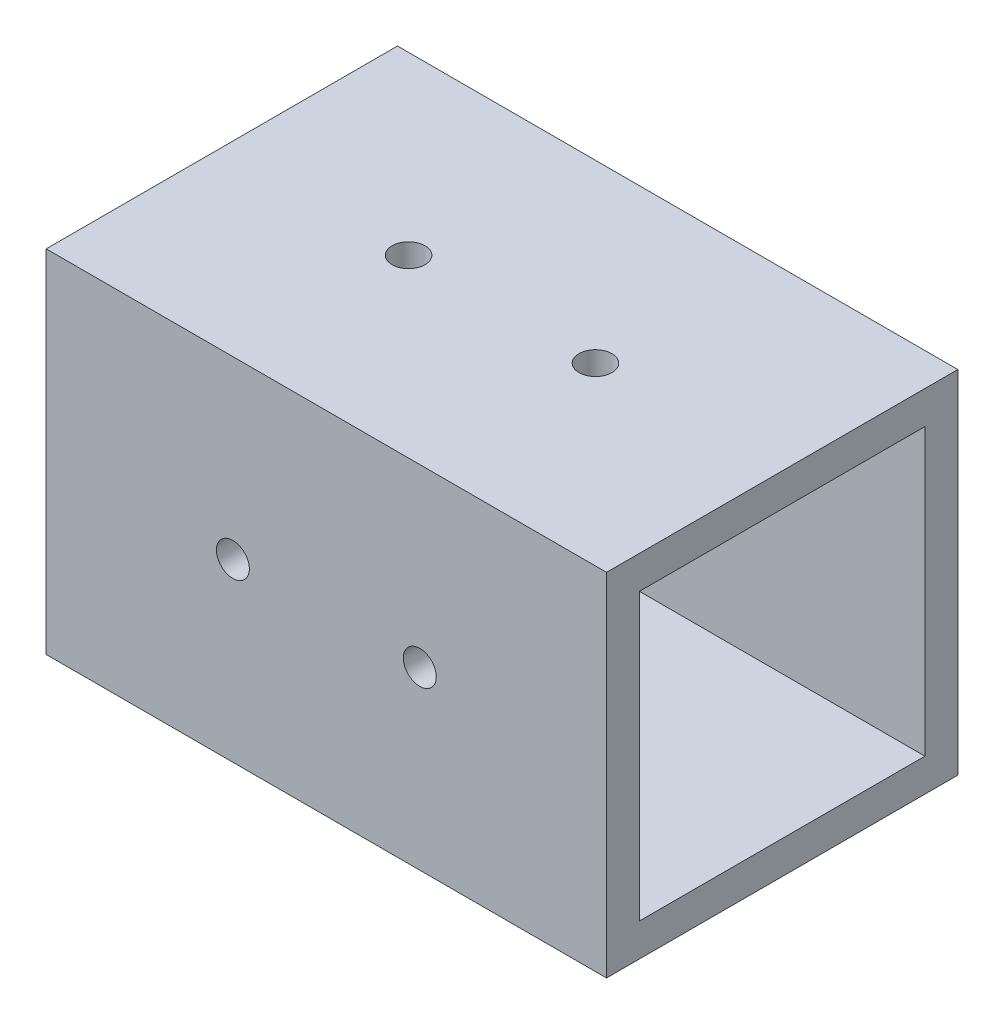
ISO-10303-21;
HEADER;
FILE_DESCRIPTION(('STEP AP214'),'2;1');
FILE_NAME('part.step','',(''),(''),'','','');
FILE_SCHEMA(('AUTOMOTIVE_DESIGN { 1 0 10303 214 1 1 1 1 }'));
ENDSEC;
DATA;
#1=APPLICATION_CONTEXT('core data for automotive mechanical design processes');
#2=APPLICATION_PROTOCOL_DEFINITION('international standard','automotive_design',2000,#1);
#3=PRODUCT_CONTEXT('',#1,'mechanical');
#4=PRODUCT('Part','Part','',(#3));
#5=PRODUCT_RELATED_PRODUCT_CATEGORY('part','',(#4));
#6=PRODUCT_DEFINITION_FORMATION('','',#4);
#7=PRODUCT_DEFINITION_CONTEXT('part definition',#1,'design');
#8=PRODUCT_DEFINITION('design','',#6,#7);
#9=PRODUCT_DEFINITION_SHAPE('','',#8);
#10=(LENGTH_UNIT() NAMED_UNIT(*) SI_UNIT(.MILLI.,.METRE.));
#11=(NAMED_UNIT(*) PLANE_ANGLE_UNIT() SI_UNIT($,.RADIAN.));
#12=(NAMED_UNIT(*) SI_UNIT($,.STERADIAN.) SOLID_ANGLE_UNIT());
#13=UNCERTAINTY_MEASURE_WITH_UNIT(LENGTH_MEASURE(1.E-05),#10,'distance_accuracy_value','');
#14=(GEOMETRIC_REPRESENTATION_CONTEXT(3) GLOBAL_UNCERTAINTY_ASSIGNED_CONTEXT((#13)) GLOBAL_UNIT_ASSIGNED_CONTEXT((#10,
#11,#12)) REPRESENTATION_CONTEXT('',''));
#15=CARTESIAN_POINT('',(0.,0.,0.));
#16=DIRECTION('',(0.,0.,1.));
#17=DIRECTION('',(1.,0.,0.));
#18=AXIS2_PLACEMENT_3D('',#15,#16,#17);
#19=CARTESIAN_POINT('',(81.025,0.,0.));
#20=DIRECTION('',(1.,0.,0.));
#21=DIRECTION('',(0.,0.,-1.));
#22=AXIS2_PLACEMENT_3D('',#19,#20,#21);
#23=PLANE('',#22);
#24=DIRECTION('',(0.,1.,0.));
#25=VECTOR('',#24,1.);
#26=CARTESIAN_POINT('',(81.025,0.,0.));
#27=LINE('',#26,#25);
#28=CARTESIAN_POINT('',(81.025,0.,0.));
#29=VERTEX_POINT('',#28);
#30=CARTESIAN_POINT('',(81.025,50.8,0.));
#31=VERTEX_POINT('',#30);
#32=EDGE_CURVE('E137',#29,#31,#27,.T.);
#33=ORIENTED_EDGE('',*,*,#32,.T.);
#34=DIRECTION('',(0.,0.,1.));
#35=VECTOR('',#34,1.);
#36=CARTESIAN_POINT('',(81.025,50.8,0.));
#37=LINE('',#36,#35);
#38=CARTESIAN_POINT('',(81.025,50.8,50.8));
#39=VERTEX_POINT('',#38);
#40=EDGE_CURVE('E140',#31,#39,#37,.T.);
#41=ORIENTED_EDGE('',*,*,#40,.T.);
#42=DIRECTION('',(0.,-1.,0.));
#43=VECTOR('',#42,1.);
#44=CARTESIAN_POINT('',(81.025,0.,50.8));
#45=LINE('',#44,#43);
#46=CARTESIAN_POINT('',(81.025,0.,50.8));
#47=VERTEX_POINT('',#46);
#48=EDGE_CURVE('E143',#39,#47,#45,.T.);
#49=ORIENTED_EDGE('',*,*,#48,.T.);
#50=DIRECTION('',(0.,0.,-1.));
#51=VECTOR('',#50,1.);
#52=CARTESIAN_POINT('',(81.025,0.,0.));
#53=LINE('',#52,#51);
#54=EDGE_CURVE('E145',#47,#29,#53,.T.);
#55=ORIENTED_EDGE('',*,*,#54,.T.);
#56=EDGE_LOOP('',(#33,#41,#49,#55));
#57=FACE_BOUND('',#56,.T.);
#58=DIRECTION('',(0.,1.,0.));
#59=VECTOR('',#58,1.);
#60=CARTESIAN_POINT('',(81.025,4.7625,4.7625));
#61=LINE('',#60,#59);
#62=CARTESIAN_POINT('',(81.025,4.7625,4.7625));
#63=VERTEX_POINT('',#62);
#64=CARTESIAN_POINT('',(81.025,46.0375,4.7625));
#65=VERTEX_POINT('',#64);
#66=EDGE_CURVE('E107',#63,#65,#61,.T.);
#67=ORIENTED_EDGE('',*,*,#66,.F.);
#68=DIRECTION('',(0.,0.,-1.));
#69=VECTOR('',#68,1.);
#70=CARTESIAN_POINT('',(81.025,4.7625,4.7625));
#71=LINE('',#70,#69);
#72=CARTESIAN_POINT('',(81.025,4.7625,46.0375));
#73=VERTEX_POINT('',#72);
#74=EDGE_CURVE('E99',#73,#63,#71,.T.);
#75=ORIENTED_EDGE('',*,*,#74,.F.);
#76=DIRECTION('',(0.,-1.,0.));
#77=VECTOR('',#76,1.);
#78=CARTESIAN_POINT('',(81.025,4.7625,46.0375));
#79=LINE('',#78,#77);
#80=CARTESIAN_POINT('',(81.025,46.0375,46.0375));
#81=VERTEX_POINT('',#80);
#82=EDGE_CURVE('E121',#81,#73,#79,.T.);
#83=ORIENTED_EDGE('',*,*,#82,.F.);
#84=DIRECTION('',(0.,0.,1.));
#85=VECTOR('',#84,1.);
#86=CARTESIAN_POINT('',(81.025,46.0375,4.7625));
#87=LINE('',#86,#85);
#88=EDGE_CURVE('E119',#65,#81,#87,.T.);
#89=ORIENTED_EDGE('',*,*,#88,.F.);
#90=EDGE_LOOP('',(#67,#75,#83,#89));
#91=FACE_BOUND('',#90,.T.);
#92=ADVANCED_FACE('F32',(#57,#91),#23,.T.);
#93=CARTESIAN_POINT('',(0.,0.,0.));
#94=DIRECTION('',(1.,0.,0.));
#95=DIRECTION('',(0.,0.,-1.));
#96=AXIS2_PLACEMENT_3D('',#93,#94,#95);
#97=PLANE('',#96);
#98=DIRECTION('',(0.,1.,0.));
#99=VECTOR('',#98,1.);
#100=CARTESIAN_POINT('',(0.,0.,0.));
#101=LINE('',#100,#99);
#102=CARTESIAN_POINT('',(0.,0.,0.));
#103=VERTEX_POINT('',#102);
#104=CARTESIAN_POINT('',(0.,50.8,0.));
#105=VERTEX_POINT('',#104);
#106=EDGE_CURVE('E115',#103,#105,#101,.T.);
#107=ORIENTED_EDGE('',*,*,#106,.F.);
#108=DIRECTION('',(0.,0.,-1.));
#109=VECTOR('',#108,1.);
#110=CARTESIAN_POINT('',(0.,0.,0.));
#111=LINE('',#110,#109);
#112=CARTESIAN_POINT('',(0.,0.,50.8));
#113=VERTEX_POINT('',#112);
#114=EDGE_CURVE('E141',#113,#103,#111,.T.);
#115=ORIENTED_EDGE('',*,*,#114,.F.);
#116=DIRECTION('',(0.,-1.,0.));
#117=VECTOR('',#116,1.);
#118=CARTESIAN_POINT('',(0.,0.,50.8));
#119=LINE('',#118,#117);
#120=CARTESIAN_POINT('',(0.,50.8,50.8));
#121=VERTEX_POINT('',#120);
#122=EDGE_CURVE('E152',#121,#113,#119,.T.);
#123=ORIENTED_EDGE('',*,*,#122,.F.);
#124=DIRECTION('',(0.,0.,1.));
#125=VECTOR('',#124,1.);
#126=CARTESIAN_POINT('',(0.,50.8,0.));
#127=LINE('',#126,#125);
#128=EDGE_CURVE('E150',#105,#121,#127,.T.);
#129=ORIENTED_EDGE('',*,*,#128,.F.);
#130=EDGE_LOOP('',(#107,#115,#123,#129));
#131=FACE_BOUND('',#130,.T.);
#132=DIRECTION('',(0.,0.,-1.));
#133=VECTOR('',#132,1.);
#134=CARTESIAN_POINT('',(0.,4.7625,4.7625));
#135=LINE('',#134,#133);
#136=CARTESIAN_POINT('',(0.,4.7625,46.0375));
#137=VERTEX_POINT('',#136);
#138=CARTESIAN_POINT('',(0.,4.7625,4.7625));
#139=VERTEX_POINT('',#138);
#140=EDGE_CURVE('E57',#137,#139,#135,.T.);
#141=ORIENTED_EDGE('',*,*,#140,.T.);
#142=DIRECTION('',(0.,1.,0.));
#143=VECTOR('',#142,1.);
#144=CARTESIAN_POINT('',(0.,4.7625,4.7625));
#145=LINE('',#144,#143);
#146=CARTESIAN_POINT('',(0.,46.0375,4.7625));
#147=VERTEX_POINT('',#146);
#148=EDGE_CURVE('E114',#139,#147,#145,.T.);
#149=ORIENTED_EDGE('',*,*,#148,.T.);
#150=DIRECTION('',(0.,0.,1.));
#151=VECTOR('',#150,1.);
#152=CARTESIAN_POINT('',(0.,46.0375,4.7625));
#153=LINE('',#152,#151);
#154=CARTESIAN_POINT('',(0.,46.0375,46.0375));
#155=VERTEX_POINT('',#154);
#156=EDGE_CURVE('E129',#147,#155,#153,.T.);
#157=ORIENTED_EDGE('',*,*,#156,.T.);
#158=DIRECTION('',(0.,-1.,0.));
#159=VECTOR('',#158,1.);
#160=CARTESIAN_POINT('',(0.,4.7625,46.0375));
#161=LINE('',#160,#159);
#162=EDGE_CURVE('E108',#155,#137,#161,.T.);
#163=ORIENTED_EDGE('',*,*,#162,.T.);
#164=EDGE_LOOP('',(#141,#149,#157,#163));
#165=FACE_BOUND('',#164,.T.);
#166=ADVANCED_FACE('F229',(#131,#165),#97,.F.);
#167=CARTESIAN_POINT('',(81.025,0.,0.));
#168=DIRECTION('',(0.,0.,1.));
#169=DIRECTION('',(1.,0.,0.));
#170=AXIS2_PLACEMENT_3D('',#167,#168,#169);
#171=PLANE('',#170);
#172=CARTESIAN_POINT('',(27.,25.4,0.));
#173=DIRECTION('',(0.,0.,1.));
#174=DIRECTION('',(1.,0.,0.));
#175=AXIS2_PLACEMENT_3D('',#172,#173,#174);
#176=CIRCLE('',#175,2.38125);
#177=CARTESIAN_POINT('',(29.38125,25.4,0.));
#178=VERTEX_POINT('',#177);
#179=EDGE_CURVE('E166',#178,#178,#176,.F.);
#180=ORIENTED_EDGE('',*,*,#179,.F.);
#181=EDGE_LOOP('',(#180));
#182=FACE_BOUND('',#181,.T.);
#183=CARTESIAN_POINT('',(54.025,25.4,0.));
#184=DIRECTION('',(0.,0.,1.));
#185=DIRECTION('',(1.,0.,0.));
#186=AXIS2_PLACEMENT_3D('',#183,#184,#185);
#187=CIRCLE('',#186,2.38125);
#188=CARTESIAN_POINT('',(56.40625,25.4,0.));
#189=VERTEX_POINT('',#188);
#190=EDGE_CURVE('E198',#189,#189,#187,.F.);
#191=ORIENTED_EDGE('',*,*,#190,.F.);
#192=EDGE_LOOP('',(#191));
#193=FACE_BOUND('',#192,.T.);
#194=ORIENTED_EDGE('',*,*,#106,.T.);
#195=DIRECTION('',(-1.,0.,0.));
#196=VECTOR('',#195,1.);
#197=CARTESIAN_POINT('',(81.025,50.8,0.));
#198=LINE('',#197,#196);
#199=EDGE_CURVE('E11',#31,#105,#198,.T.);
#200=ORIENTED_EDGE('',*,*,#199,.F.);
#201=ORIENTED_EDGE('',*,*,#32,.F.);
#202=DIRECTION('',(-1.,0.,0.));
#203=VECTOR('',#202,1.);
#204=CARTESIAN_POINT('',(81.025,0.,0.));
#205=LINE('',#204,#203);
#206=EDGE_CURVE('E147',#29,#103,#205,.T.);
#207=ORIENTED_EDGE('',*,*,#206,.T.);
#208=EDGE_LOOP('',(#194,#200,#201,#207));
#209=FACE_BOUND('',#208,.T.);
#210=ADVANCED_FACE('F34',(#182,#193,#209),#171,.F.);
#211=CARTESIAN_POINT('',(81.025,50.8,0.));
#212=DIRECTION('',(0.,-1.,0.));
#213=DIRECTION('',(0.,0.,-1.));
#214=AXIS2_PLACEMENT_3D('',#211,#212,#213);
#215=PLANE('',#214);
#216=CARTESIAN_POINT('',(27.,50.8,25.4));
#217=DIRECTION('',(0.,-1.,0.));
#218=DIRECTION('',(0.,0.,-1.));
#219=AXIS2_PLACEMENT_3D('',#216,#217,#218);
#220=CIRCLE('',#219,2.38125);
#221=CARTESIAN_POINT('',(27.,50.8,23.01875));
#222=VERTEX_POINT('',#221);
#223=EDGE_CURVE('E191',#222,#222,#220,.T.);
#224=ORIENTED_EDGE('',*,*,#223,.T.);
#225=EDGE_LOOP('',(#224));
#226=FACE_BOUND('',#225,.T.);
#227=CARTESIAN_POINT('',(54.025,50.8,25.4));
#228=DIRECTION('',(0.,-1.,0.));
#229=DIRECTION('',(0.,0.,-1.));
#230=AXIS2_PLACEMENT_3D('',#227,#228,#229);
#231=CIRCLE('',#230,2.38125);
#232=CARTESIAN_POINT('',(54.025,50.8,23.01875));
#233=VERTEX_POINT('',#232);
#234=EDGE_CURVE('E176',#233,#233,#231,.T.);
#235=ORIENTED_EDGE('',*,*,#234,.T.);
#236=EDGE_LOOP('',(#235));
#237=FACE_BOUND('',#236,.T.);
#238=ORIENTED_EDGE('',*,*,#128,.T.);
#239=DIRECTION('',(-1.,0.,0.));
#240=VECTOR('',#239,1.);
#241=CARTESIAN_POINT('',(81.025,50.8,50.8));
#242=LINE('',#241,#240);
#243=EDGE_CURVE('E41',#39,#121,#242,.T.);
#244=ORIENTED_EDGE('',*,*,#243,.F.);
#245=ORIENTED_EDGE('',*,*,#40,.F.);
#246=ORIENTED_EDGE('',*,*,#199,.T.);
#247=EDGE_LOOP('',(#238,#244,#245,#246));
#248=FACE_BOUND('',#247,.T.);
#249=ADVANCED_FACE('F228',(#226,#237,#248),#215,.F.);
#250=CARTESIAN_POINT('',(81.025,0.,50.8));
#251=DIRECTION('',(0.,0.,-1.));
#252=DIRECTION('',(0.,1.,0.));
#253=AXIS2_PLACEMENT_3D('',#250,#251,#252);
#254=PLANE('',#253);
#255=CARTESIAN_POINT('',(27.,25.4,50.8));
#256=DIRECTION('',(0.,0.,1.));
#257=DIRECTION('',(1.,0.,0.));
#258=AXIS2_PLACEMENT_3D('',#255,#256,#257);
#259=CIRCLE('',#258,2.38125);
#260=CARTESIAN_POINT('',(29.38125,25.4,50.8));
#261=VERTEX_POINT('',#260);
#262=EDGE_CURVE('E195',#261,#261,#259,.T.);
#263=ORIENTED_EDGE('',*,*,#262,.F.);
#264=EDGE_LOOP('',(#263));
#265=FACE_BOUND('',#264,.T.);
#266=CARTESIAN_POINT('',(54.025,25.4,50.8));
#267=DIRECTION('',(0.,0.,1.));
#268=DIRECTION('',(1.,0.,0.));
#269=AXIS2_PLACEMENT_3D('',#266,#267,#268);
#270=CIRCLE('',#269,2.38125);
#271=CARTESIAN_POINT('',(56.40625,25.4,50.8));
#272=VERTEX_POINT('',#271);
#273=EDGE_CURVE('E194',#272,#272,#270,.T.);
#274=ORIENTED_EDGE('',*,*,#273,.F.);
#275=EDGE_LOOP('',(#274));
#276=FACE_BOUND('',#275,.T.);
#277=ORIENTED_EDGE('',*,*,#122,.T.);
#278=DIRECTION('',(-1.,0.,0.));
#279=VECTOR('',#278,1.);
#280=CARTESIAN_POINT('',(81.025,0.,50.8));
#281=LINE('',#280,#279);
#282=EDGE_CURVE('E157',#47,#113,#281,.T.);
#283=ORIENTED_EDGE('',*,*,#282,.F.);
#284=ORIENTED_EDGE('',*,*,#48,.F.);
#285=ORIENTED_EDGE('',*,*,#243,.T.);
#286=EDGE_LOOP('',(#277,#283,#284,#285));
#287=FACE_BOUND('',#286,.T.);
#288=ADVANCED_FACE('F248',(#265,#276,#287),#254,.F.);
#289=CARTESIAN_POINT('',(81.025,0.,0.));
#290=DIRECTION('',(0.,1.,0.));
#291=DIRECTION('',(0.,0.,1.));
#292=AXIS2_PLACEMENT_3D('',#289,#290,#291);
#293=PLANE('',#292);
#294=CARTESIAN_POINT('',(27.,0.,25.4));
#295=DIRECTION('',(0.,-1.,0.));
#296=DIRECTION('',(0.,0.,-1.));
#297=AXIS2_PLACEMENT_3D('',#294,#295,#296);
#298=CIRCLE('',#297,2.38125);
#299=CARTESIAN_POINT('',(27.,0.,23.01875));
#300=VERTEX_POINT('',#299);
#301=EDGE_CURVE('E172',#300,#300,#298,.T.);
#302=ORIENTED_EDGE('',*,*,#301,.F.);
#303=EDGE_LOOP('',(#302));
#304=FACE_BOUND('',#303,.T.);
#305=CARTESIAN_POINT('',(54.025,0.,25.4));
#306=DIRECTION('',(0.,-1.,0.));
#307=DIRECTION('',(0.,0.,-1.));
#308=AXIS2_PLACEMENT_3D('',#305,#306,#307);
#309=CIRCLE('',#308,2.38125);
#310=CARTESIAN_POINT('',(54.025,0.,23.01875));
#311=VERTEX_POINT('',#310);
#312=EDGE_CURVE('E179',#311,#311,#309,.T.);
#313=ORIENTED_EDGE('',*,*,#312,.F.);
#314=EDGE_LOOP('',(#313));
#315=FACE_BOUND('',#314,.T.);
#316=ORIENTED_EDGE('',*,*,#114,.T.);
#317=ORIENTED_EDGE('',*,*,#206,.F.);
#318=ORIENTED_EDGE('',*,*,#54,.F.);
#319=ORIENTED_EDGE('',*,*,#282,.T.);
#320=EDGE_LOOP('',(#316,#317,#318,#319));
#321=FACE_BOUND('',#320,.T.);
#322=ADVANCED_FACE('F246',(#304,#315,#321),#293,.F.);
#323=CARTESIAN_POINT('',(81.025,4.7625,4.7625));
#324=DIRECTION('',(0.,1.,0.));
#325=DIRECTION('',(0.,0.,1.));
#326=AXIS2_PLACEMENT_3D('',#323,#324,#325);
#327=PLANE('',#326);
#328=CARTESIAN_POINT('',(27.,4.7625,25.4));
#329=DIRECTION('',(0.,1.,0.));
#330=DIRECTION('',(0.,0.,1.));
#331=AXIS2_PLACEMENT_3D('',#328,#329,#330);
#332=CIRCLE('',#331,2.38125);
#333=CARTESIAN_POINT('',(27.,4.7625,27.78125));
#334=VERTEX_POINT('',#333);
#335=EDGE_CURVE('E188',#334,#334,#332,.T.);
#336=ORIENTED_EDGE('',*,*,#335,.F.);
#337=EDGE_LOOP('',(#336));
#338=FACE_BOUND('',#337,.T.);
#339=CARTESIAN_POINT('',(54.025,4.7625,25.4));
#340=DIRECTION('',(0.,1.,0.));
#341=DIRECTION('',(0.,0.,1.));
#342=AXIS2_PLACEMENT_3D('',#339,#340,#341);
#343=CIRCLE('',#342,2.38125);
#344=CARTESIAN_POINT('',(54.025,4.7625,27.78125));
#345=VERTEX_POINT('',#344);
#346=EDGE_CURVE('E171',#345,#345,#343,.T.);
#347=ORIENTED_EDGE('',*,*,#346,.F.);
#348=EDGE_LOOP('',(#347));
#349=FACE_BOUND('',#348,.T.);
#350=ORIENTED_EDGE('',*,*,#140,.F.);
#351=DIRECTION('',(-1.,0.,0.));
#352=VECTOR('',#351,1.);
#353=CARTESIAN_POINT('',(81.025,4.7625,46.0375));
#354=LINE('',#353,#352);
#355=EDGE_CURVE('E103',#73,#137,#354,.T.);
#356=ORIENTED_EDGE('',*,*,#355,.F.);
#357=ORIENTED_EDGE('',*,*,#74,.T.);
#358=DIRECTION('',(-1.,0.,0.));
#359=VECTOR('',#358,1.);
#360=CARTESIAN_POINT('',(81.025,4.7625,4.7625));
#361=LINE('',#360,#359);
#362=EDGE_CURVE('E102',#63,#139,#361,.T.);
#363=ORIENTED_EDGE('',*,*,#362,.T.);
#364=EDGE_LOOP('',(#350,#356,#357,#363));
#365=FACE_BOUND('',#364,.T.);
#366=ADVANCED_FACE('F101',(#338,#349,#365),#327,.T.);
#367=CARTESIAN_POINT('',(81.025,4.7625,4.7625));
#368=DIRECTION('',(0.,0.,1.));
#369=DIRECTION('',(1.,0.,0.));
#370=AXIS2_PLACEMENT_3D('',#367,#368,#369);
#371=PLANE('',#370);
#372=CARTESIAN_POINT('',(27.,25.4,4.7625));
#373=DIRECTION('',(0.,0.,1.));
#374=DIRECTION('',(1.,0.,0.));
#375=AXIS2_PLACEMENT_3D('',#372,#373,#374);
#376=CIRCLE('',#375,2.38125);
#377=CARTESIAN_POINT('',(29.38125,25.4,4.7625));
#378=VERTEX_POINT('',#377);
#379=EDGE_CURVE('E127',#378,#378,#376,.T.);
#380=ORIENTED_EDGE('',*,*,#379,.F.);
#381=EDGE_LOOP('',(#380));
#382=FACE_BOUND('',#381,.T.);
#383=CARTESIAN_POINT('',(54.025,25.4,4.7625));
#384=DIRECTION('',(0.,0.,1.));
#385=DIRECTION('',(1.,0.,0.));
#386=AXIS2_PLACEMENT_3D('',#383,#384,#385);
#387=CIRCLE('',#386,2.38125);
#388=CARTESIAN_POINT('',(56.40625,25.4,4.7625));
#389=VERTEX_POINT('',#388);
#390=EDGE_CURVE('E165',#389,#389,#387,.T.);
#391=ORIENTED_EDGE('',*,*,#390,.F.);
#392=EDGE_LOOP('',(#391));
#393=FACE_BOUND('',#392,.T.);
#394=ORIENTED_EDGE('',*,*,#148,.F.);
#395=ORIENTED_EDGE('',*,*,#362,.F.);
#396=ORIENTED_EDGE('',*,*,#66,.T.);
#397=DIRECTION('',(-1.,0.,0.));
#398=VECTOR('',#397,1.);
#399=CARTESIAN_POINT('',(81.025,46.0375,4.7625));
#400=LINE('',#399,#398);
#401=EDGE_CURVE('E116',#65,#147,#400,.T.);
#402=ORIENTED_EDGE('',*,*,#401,.T.);
#403=EDGE_LOOP('',(#394,#395,#396,#402));
#404=FACE_BOUND('',#403,.T.);
#405=ADVANCED_FACE('F111',(#382,#393,#404),#371,.T.);
#406=CARTESIAN_POINT('',(81.025,46.0375,4.7625));
#407=DIRECTION('',(0.,-1.,0.));
#408=DIRECTION('',(0.,0.,-1.));
#409=AXIS2_PLACEMENT_3D('',#406,#407,#408);
#410=PLANE('',#409);
#411=CARTESIAN_POINT('',(27.,46.0375,25.4));
#412=DIRECTION('',(0.,-1.,0.));
#413=DIRECTION('',(0.,0.,-1.));
#414=AXIS2_PLACEMENT_3D('',#411,#412,#413);
#415=CIRCLE('',#414,2.38125);
#416=CARTESIAN_POINT('',(27.,46.0375,23.01875));
#417=VERTEX_POINT('',#416);
#418=EDGE_CURVE('E36',#417,#417,#415,.T.);
#419=ORIENTED_EDGE('',*,*,#418,.F.);
#420=EDGE_LOOP('',(#419));
#421=FACE_BOUND('',#420,.T.);
#422=CARTESIAN_POINT('',(54.025,46.0375,25.4));
#423=DIRECTION('',(0.,-1.,0.));
#424=DIRECTION('',(0.,0.,-1.));
#425=AXIS2_PLACEMENT_3D('',#422,#423,#424);
#426=CIRCLE('',#425,2.38125);
#427=CARTESIAN_POINT('',(54.025,46.0375,23.01875));
#428=VERTEX_POINT('',#427);
#429=EDGE_CURVE('E169',#428,#428,#426,.T.);
#430=ORIENTED_EDGE('',*,*,#429,.F.);
#431=EDGE_LOOP('',(#430));
#432=FACE_BOUND('',#431,.T.);
#433=ORIENTED_EDGE('',*,*,#156,.F.);
#434=ORIENTED_EDGE('',*,*,#401,.F.);
#435=ORIENTED_EDGE('',*,*,#88,.T.);
#436=DIRECTION('',(-1.,0.,0.));
#437=VECTOR('',#436,1.);
#438=CARTESIAN_POINT('',(81.025,46.0375,46.0375));
#439=LINE('',#438,#437);
#440=EDGE_CURVE('E49',#81,#155,#439,.T.);
#441=ORIENTED_EDGE('',*,*,#440,.T.);
#442=EDGE_LOOP('',(#433,#434,#435,#441));
#443=FACE_BOUND('',#442,.T.);
#444=ADVANCED_FACE('F214',(#421,#432,#443),#410,.T.);
#445=CARTESIAN_POINT('',(81.025,4.7625,46.0375));
#446=DIRECTION('',(0.,0.,-1.));
#447=DIRECTION('',(-1.,0.,0.));
#448=AXIS2_PLACEMENT_3D('',#445,#446,#447);
#449=PLANE('',#448);
#450=CARTESIAN_POINT('',(27.,25.4,46.0375));
#451=DIRECTION('',(0.,0.,-1.));
#452=DIRECTION('',(-1.,0.,0.));
#453=AXIS2_PLACEMENT_3D('',#450,#451,#452);
#454=CIRCLE('',#453,2.38125);
#455=CARTESIAN_POINT('',(24.61875,25.4,46.0375));
#456=VERTEX_POINT('',#455);
#457=EDGE_CURVE('E167',#456,#456,#454,.T.);
#458=ORIENTED_EDGE('',*,*,#457,.F.);
#459=EDGE_LOOP('',(#458));
#460=FACE_BOUND('',#459,.T.);
#461=CARTESIAN_POINT('',(54.025,25.4,46.0375));
#462=DIRECTION('',(0.,0.,-1.));
#463=DIRECTION('',(-1.,0.,0.));
#464=AXIS2_PLACEMENT_3D('',#461,#462,#463);
#465=CIRCLE('',#464,2.38125);
#466=CARTESIAN_POINT('',(51.64375,25.4,46.0375));
#467=VERTEX_POINT('',#466);
#468=EDGE_CURVE('E162',#467,#467,#465,.T.);
#469=ORIENTED_EDGE('',*,*,#468,.F.);
#470=EDGE_LOOP('',(#469));
#471=FACE_BOUND('',#470,.T.);
#472=ORIENTED_EDGE('',*,*,#162,.F.);
#473=ORIENTED_EDGE('',*,*,#440,.F.);
#474=ORIENTED_EDGE('',*,*,#82,.T.);
#475=ORIENTED_EDGE('',*,*,#355,.T.);
#476=EDGE_LOOP('',(#472,#473,#474,#475));
#477=FACE_BOUND('',#476,.T.);
#478=ADVANCED_FACE('F273',(#460,#471,#477),#449,.T.);
#479=CARTESIAN_POINT('',(54.025,25.4,-6.73519209080187));
#480=DIRECTION('',(0.,0.,1.));
#481=DIRECTION('',(1.,0.,0.));
#482=AXIS2_PLACEMENT_3D('',#479,#480,#481);
#483=CYLINDRICAL_SURFACE('',#482,2.38125);
#484=ORIENTED_EDGE('',*,*,#468,.T.);
#485=EDGE_LOOP('',(#484));
#486=FACE_BOUND('',#485,.T.);
#487=ORIENTED_EDGE('',*,*,#273,.T.);
#488=EDGE_LOOP('',(#487));
#489=FACE_BOUND('',#488,.T.);
#490=ADVANCED_FACE('F223',(#486,#489),#483,.F.);
#491=CARTESIAN_POINT('',(27.,25.4,-6.73519209080187));
#492=DIRECTION('',(0.,0.,1.));
#493=DIRECTION('',(1.,0.,0.));
#494=AXIS2_PLACEMENT_3D('',#491,#492,#493);
#495=CYLINDRICAL_SURFACE('',#494,2.38125);
#496=ORIENTED_EDGE('',*,*,#457,.T.);
#497=EDGE_LOOP('',(#496));
#498=FACE_BOUND('',#497,.T.);
#499=ORIENTED_EDGE('',*,*,#262,.T.);
#500=EDGE_LOOP('',(#499));
#501=FACE_BOUND('',#500,.T.);
#502=ADVANCED_FACE('F221',(#498,#501),#495,.F.);
#503=ORIENTED_EDGE('',*,*,#390,.T.);
#504=EDGE_LOOP('',(#503));
#505=FACE_BOUND('',#504,.T.);
#506=ORIENTED_EDGE('',*,*,#190,.T.);
#507=EDGE_LOOP('',(#506));
#508=FACE_BOUND('',#507,.T.);
#509=ADVANCED_FACE('F218',(#505,#508),#483,.F.);
#510=ORIENTED_EDGE('',*,*,#379,.T.);
#511=EDGE_LOOP('',(#510));
#512=FACE_BOUND('',#511,.T.);
#513=ORIENTED_EDGE('',*,*,#179,.T.);
#514=EDGE_LOOP('',(#513));
#515=FACE_BOUND('',#514,.T.);
#516=ADVANCED_FACE('F209',(#512,#515),#495,.F.);
#517=CARTESIAN_POINT('',(54.025,52.324,25.4));
#518=DIRECTION('',(0.,-1.,0.));
#519=DIRECTION('',(0.,0.,-1.));
#520=AXIS2_PLACEMENT_3D('',#517,#518,#519);
#521=CYLINDRICAL_SURFACE('',#520,2.38125);
#522=ORIENTED_EDGE('',*,*,#429,.T.);
#523=EDGE_LOOP('',(#522));
#524=FACE_BOUND('',#523,.T.);
#525=ORIENTED_EDGE('',*,*,#234,.F.);
#526=EDGE_LOOP('',(#525));
#527=FACE_BOUND('',#526,.T.);
#528=ADVANCED_FACE('F283',(#524,#527),#521,.F.);
#529=CARTESIAN_POINT('',(27.,52.324,25.4));
#530=DIRECTION('',(0.,-1.,0.));
#531=DIRECTION('',(0.,0.,-1.));
#532=AXIS2_PLACEMENT_3D('',#529,#530,#531);
#533=CYLINDRICAL_SURFACE('',#532,2.38125);
#534=ORIENTED_EDGE('',*,*,#418,.T.);
#535=EDGE_LOOP('',(#534));
#536=FACE_BOUND('',#535,.T.);
#537=ORIENTED_EDGE('',*,*,#223,.F.);
#538=EDGE_LOOP('',(#537));
#539=FACE_BOUND('',#538,.T.);
#540=ADVANCED_FACE('F286',(#536,#539),#533,.F.);
#541=ORIENTED_EDGE('',*,*,#346,.T.);
#542=EDGE_LOOP('',(#541));
#543=FACE_BOUND('',#542,.T.);
#544=ORIENTED_EDGE('',*,*,#312,.T.);
#545=EDGE_LOOP('',(#544));
#546=FACE_BOUND('',#545,.T.);
#547=ADVANCED_FACE('F287',(#543,#546),#521,.F.);
#548=ORIENTED_EDGE('',*,*,#335,.T.);
#549=EDGE_LOOP('',(#548));
#550=FACE_BOUND('',#549,.T.);
#551=ORIENTED_EDGE('',*,*,#301,.T.);
#552=EDGE_LOOP('',(#551));
#553=FACE_BOUND('',#552,.T.);
#554=ADVANCED_FACE('F290',(#550,#553),#533,.F.);
#555=CLOSED_SHELL('',(#92,#166,#210,#249,#288,#322,#366,#405,#444,#478,#490,#502,#509,#516,#528,
#540,#547,#554));
#556=MANIFOLD_SOLID_BREP('B2',#555);
#557=ADVANCED_BREP_SHAPE_REPRESENTATION('',(#18,#556),#14);
#558=SHAPE_DEFINITION_REPRESENTATION(#9,#557);
ENDSEC;
END-ISO-10303-21;
